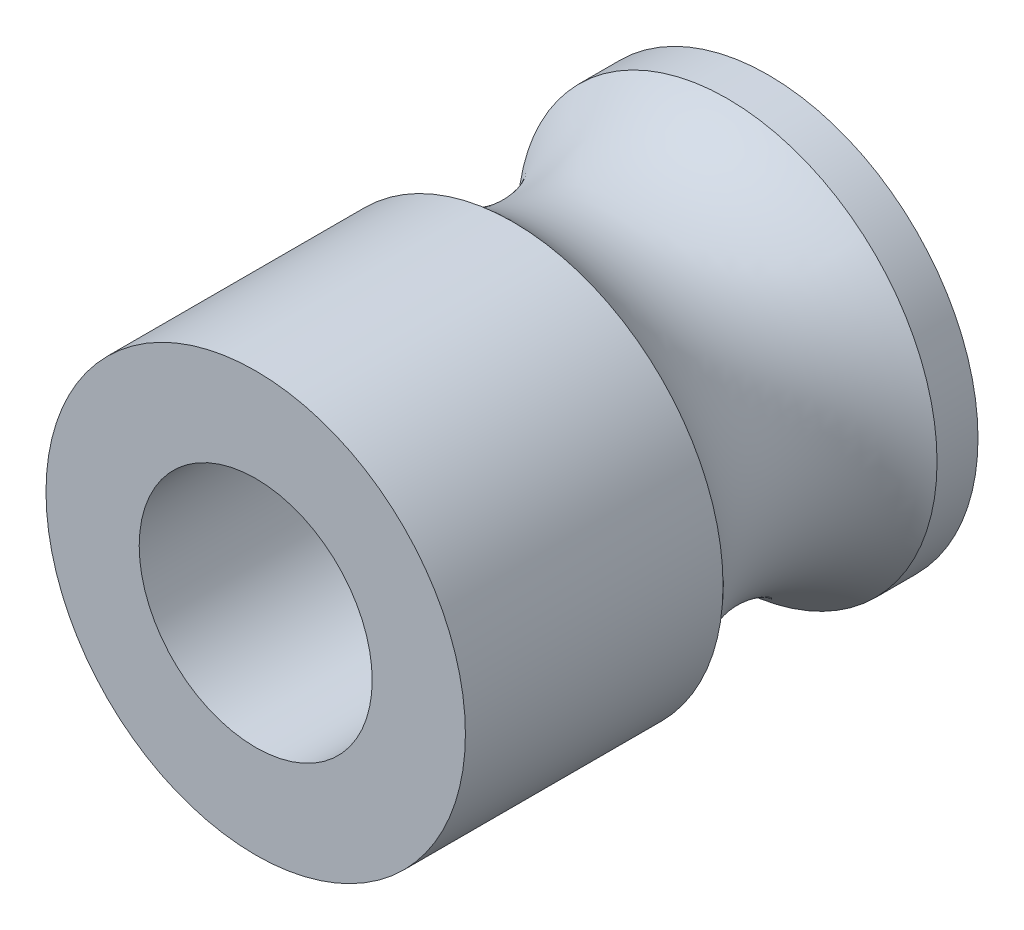
ISO-10303-21;
HEADER;
FILE_DESCRIPTION(('STEP AP214'),'2;1');
FILE_NAME('part.step','',(''),(''),'','','');
FILE_SCHEMA(('AUTOMOTIVE_DESIGN { 1 0 10303 214 1 1 1 1 }'));
ENDSEC;
DATA;
#1=APPLICATION_CONTEXT('core data for automotive mechanical design processes');
#2=APPLICATION_PROTOCOL_DEFINITION('international standard','automotive_design',2000,#1);
#3=PRODUCT_CONTEXT('',#1,'mechanical');
#4=PRODUCT('Part','Part','',(#3));
#5=PRODUCT_RELATED_PRODUCT_CATEGORY('part','',(#4));
#6=PRODUCT_DEFINITION_FORMATION('','',#4);
#7=PRODUCT_DEFINITION_CONTEXT('part definition',#1,'design');
#8=PRODUCT_DEFINITION('design','',#6,#7);
#9=PRODUCT_DEFINITION_SHAPE('','',#8);
#10=(LENGTH_UNIT() NAMED_UNIT(*) SI_UNIT(.MILLI.,.METRE.));
#11=(NAMED_UNIT(*) PLANE_ANGLE_UNIT() SI_UNIT($,.RADIAN.));
#12=(NAMED_UNIT(*) SI_UNIT($,.STERADIAN.) SOLID_ANGLE_UNIT());
#13=UNCERTAINTY_MEASURE_WITH_UNIT(LENGTH_MEASURE(1.E-05),#10,'distance_accuracy_value','');
#14=(GEOMETRIC_REPRESENTATION_CONTEXT(3) GLOBAL_UNCERTAINTY_ASSIGNED_CONTEXT((#13)) GLOBAL_UNIT_ASSIGNED_CONTEXT((#10,
#11,#12)) REPRESENTATION_CONTEXT('',''));
#15=CARTESIAN_POINT('',(0.,0.,0.));
#16=DIRECTION('',(0.,0.,1.));
#17=DIRECTION('',(1.,0.,0.));
#18=AXIS2_PLACEMENT_3D('',#15,#16,#17);
#19=CARTESIAN_POINT('',(0.,0.,0.));
#20=DIRECTION('',(0.,0.,1.));
#21=DIRECTION('',(1.,0.,0.));
#22=AXIS2_PLACEMENT_3D('',#19,#20,#21);
#23=CYLINDRICAL_SURFACE('',#22,4.5);
#24=CARTESIAN_POINT('',(0.,0.,0.));
#25=DIRECTION('',(0.,0.,1.));
#26=DIRECTION('',(1.,0.,0.));
#27=AXIS2_PLACEMENT_3D('',#24,#25,#26);
#28=CIRCLE('',#27,4.5);
#29=CARTESIAN_POINT('',(4.5,0.,0.));
#30=VERTEX_POINT('',#29);
#31=EDGE_CURVE('E44',#30,#30,#28,.T.);
#32=ORIENTED_EDGE('',*,*,#31,.T.);
#33=EDGE_LOOP('',(#32));
#34=FACE_BOUND('',#33,.T.);
#35=CARTESIAN_POINT('',(0.,0.,0.878807499358994));
#36=DIRECTION('',(0.,0.,1.));
#37=DIRECTION('',(1.,0.,0.));
#38=AXIS2_PLACEMENT_3D('',#35,#36,#37);
#39=CIRCLE('',#38,4.5);
#40=CARTESIAN_POINT('',(4.5,0.,0.878807499358993));
#41=VERTEX_POINT('',#40);
#42=EDGE_CURVE('E10',#41,#41,#39,.T.);
#43=ORIENTED_EDGE('',*,*,#42,.F.);
#44=EDGE_LOOP('',(#43));
#45=FACE_BOUND('',#44,.T.);
#46=ADVANCED_FACE('F30',(#34,#45),#23,.T.);
#47=CARTESIAN_POINT('',(0.,0.,3.175));
#48=DIRECTION('',(0.,0.,1.));
#49=DIRECTION('',(1.,0.,0.));
#50=AXIS2_PLACEMENT_3D('',#47,#48,#49);
#51=TOROIDAL_SURFACE('',#50,6.8,3.25);
#52=ORIENTED_EDGE('',*,*,#42,.T.);
#53=EDGE_LOOP('',(#52));
#54=FACE_BOUND('',#53,.T.);
#55=CARTESIAN_POINT('',(0.,0.,5.47119250064101));
#56=DIRECTION('',(0.,0.,1.));
#57=DIRECTION('',(1.,0.,0.));
#58=AXIS2_PLACEMENT_3D('',#55,#56,#57);
#59=CIRCLE('',#58,4.5);
#60=CARTESIAN_POINT('',(4.5,0.,5.47119250064101));
#61=VERTEX_POINT('',#60);
#62=EDGE_CURVE('E36',#61,#61,#59,.T.);
#63=ORIENTED_EDGE('',*,*,#62,.F.);
#64=EDGE_LOOP('',(#63));
#65=FACE_BOUND('',#64,.T.);
#66=ADVANCED_FACE('F67',(#54,#65),#51,.F.);
#67=CARTESIAN_POINT('',(0.,0.,0.));
#68=DIRECTION('',(0.,0.,1.));
#69=DIRECTION('',(1.,0.,0.));
#70=AXIS2_PLACEMENT_3D('',#67,#68,#69);
#71=CYLINDRICAL_SURFACE('',#70,4.5);
#72=ORIENTED_EDGE('',*,*,#62,.T.);
#73=EDGE_LOOP('',(#72));
#74=FACE_BOUND('',#73,.T.);
#75=CARTESIAN_POINT('',(0.,0.,11.));
#76=DIRECTION('',(0.,0.,1.));
#77=DIRECTION('',(1.,0.,0.));
#78=AXIS2_PLACEMENT_3D('',#75,#76,#77);
#79=CIRCLE('',#78,4.5);
#80=CARTESIAN_POINT('',(4.5,0.,11.));
#81=VERTEX_POINT('',#80);
#82=EDGE_CURVE('E40',#81,#81,#79,.T.);
#83=ORIENTED_EDGE('',*,*,#82,.F.);
#84=EDGE_LOOP('',(#83));
#85=FACE_BOUND('',#84,.T.);
#86=ADVANCED_FACE('F62',(#74,#85),#71,.T.);
#87=CARTESIAN_POINT('',(0.,0.,11.));
#88=DIRECTION('',(0.,0.,1.));
#89=DIRECTION('',(1.,0.,0.));
#90=AXIS2_PLACEMENT_3D('',#87,#88,#89);
#91=PLANE('',#90);
#92=CARTESIAN_POINT('',(0.,0.,11.));
#93=DIRECTION('',(0.,0.,1.));
#94=DIRECTION('',(1.,0.,0.));
#95=AXIS2_PLACEMENT_3D('',#92,#93,#94);
#96=CIRCLE('',#95,2.49999999999999);
#97=CARTESIAN_POINT('',(2.49999999999999,0.,11.));
#98=VERTEX_POINT('',#97);
#99=EDGE_CURVE('E52',#98,#98,#96,.T.);
#100=ORIENTED_EDGE('',*,*,#99,.F.);
#101=EDGE_LOOP('',(#100));
#102=FACE_BOUND('',#101,.T.);
#103=ORIENTED_EDGE('',*,*,#82,.T.);
#104=EDGE_LOOP('',(#103));
#105=FACE_BOUND('',#104,.T.);
#106=ADVANCED_FACE('F58',(#102,#105),#91,.T.);
#107=CARTESIAN_POINT('',(4.5,0.,0.));
#108=DIRECTION('',(0.,0.,-1.));
#109=DIRECTION('',(-1.,0.,0.));
#110=AXIS2_PLACEMENT_3D('',#107,#108,#109);
#111=PLANE('',#110);
#112=CARTESIAN_POINT('',(0.,0.,0.));
#113=DIRECTION('',(0.,0.,1.));
#114=DIRECTION('',(1.,0.,0.));
#115=AXIS2_PLACEMENT_3D('',#112,#113,#114);
#116=CIRCLE('',#115,2.5);
#117=CARTESIAN_POINT('',(2.5,0.,0.));
#118=VERTEX_POINT('',#117);
#119=EDGE_CURVE('E49',#118,#118,#116,.T.);
#120=ORIENTED_EDGE('',*,*,#119,.T.);
#121=EDGE_LOOP('',(#120));
#122=FACE_BOUND('',#121,.T.);
#123=ORIENTED_EDGE('',*,*,#31,.F.);
#124=EDGE_LOOP('',(#123));
#125=FACE_BOUND('',#124,.T.);
#126=ADVANCED_FACE('F61',(#122,#125),#111,.T.);
#127=CARTESIAN_POINT('',(0.,0.,11.));
#128=DIRECTION('',(0.,0.,1.));
#129=DIRECTION('',(1.,0.,0.));
#130=AXIS2_PLACEMENT_3D('',#127,#128,#129);
#131=CYLINDRICAL_SURFACE('',#130,2.49999999999999);
#132=ORIENTED_EDGE('',*,*,#119,.F.);
#133=EDGE_LOOP('',(#132));
#134=FACE_BOUND('',#133,.T.);
#135=ORIENTED_EDGE('',*,*,#99,.T.);
#136=EDGE_LOOP('',(#135));
#137=FACE_BOUND('',#136,.T.);
#138=ADVANCED_FACE('F56',(#134,#137),#131,.F.);
#139=CLOSED_SHELL('',(#46,#66,#86,#106,#126,#138));
#140=MANIFOLD_SOLID_BREP('B2',#139);
#141=ADVANCED_BREP_SHAPE_REPRESENTATION('',(#18,#140),#14);
#142=SHAPE_DEFINITION_REPRESENTATION(#9,#141);
ENDSEC;
END-ISO-10303-21;
